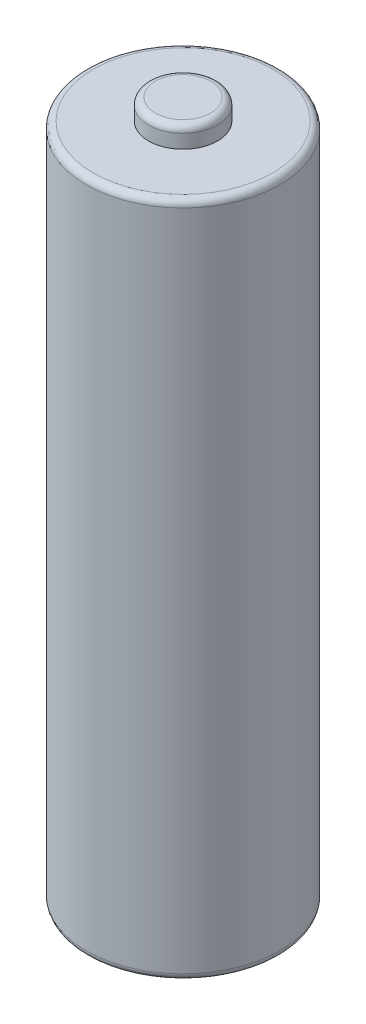
ISO-10303-21;
HEADER;
FILE_DESCRIPTION(('STEP AP214'),'2;1');
FILE_NAME('part.step','',(''),(''),'','','');
FILE_SCHEMA(('AUTOMOTIVE_DESIGN { 1 0 10303 214 1 1 1 1 }'));
ENDSEC;
DATA;
#1=APPLICATION_CONTEXT('core data for automotive mechanical design processes');
#2=APPLICATION_PROTOCOL_DEFINITION('international standard','automotive_design',2000,#1);
#3=PRODUCT_CONTEXT('',#1,'mechanical');
#4=PRODUCT('Part','Part','',(#3));
#5=PRODUCT_RELATED_PRODUCT_CATEGORY('part','',(#4));
#6=PRODUCT_DEFINITION_FORMATION('','',#4);
#7=PRODUCT_DEFINITION_CONTEXT('part definition',#1,'design');
#8=PRODUCT_DEFINITION('design','',#6,#7);
#9=PRODUCT_DEFINITION_SHAPE('','',#8);
#10=(LENGTH_UNIT() NAMED_UNIT(*) SI_UNIT(.MILLI.,.METRE.));
#11=(NAMED_UNIT(*) PLANE_ANGLE_UNIT() SI_UNIT($,.RADIAN.));
#12=(NAMED_UNIT(*) SI_UNIT($,.STERADIAN.) SOLID_ANGLE_UNIT());
#13=UNCERTAINTY_MEASURE_WITH_UNIT(LENGTH_MEASURE(1.E-05),#10,'distance_accuracy_value','');
#14=(GEOMETRIC_REPRESENTATION_CONTEXT(3) GLOBAL_UNCERTAINTY_ASSIGNED_CONTEXT((#13)) GLOBAL_UNIT_ASSIGNED_CONTEXT((#10,
#11,#12)) REPRESENTATION_CONTEXT('',''));
#15=CARTESIAN_POINT('',(0.,0.,0.));
#16=DIRECTION('',(0.,0.,1.));
#17=DIRECTION('',(1.,0.,0.));
#18=AXIS2_PLACEMENT_3D('',#15,#16,#17);
#19=CARTESIAN_POINT('',(0.,49.,0.));
#20=DIRECTION('',(0.,-1.,0.));
#21=DIRECTION('',(0.,0.,-1.));
#22=AXIS2_PLACEMENT_3D('',#19,#20,#21);
#23=CYLINDRICAL_SURFACE('',#22,7.);
#24=CARTESIAN_POINT('',(0.,0.5,0.));
#25=DIRECTION('',(0.,1.,0.));
#26=DIRECTION('',(0.,0.,1.));
#27=AXIS2_PLACEMENT_3D('',#24,#25,#26);
#28=CIRCLE('',#27,7.);
#29=CARTESIAN_POINT('',(0.,0.5,7.));
#30=VERTEX_POINT('',#29);
#31=EDGE_CURVE('E52',#30,#30,#28,.T.);
#32=ORIENTED_EDGE('',*,*,#31,.T.);
#33=EDGE_LOOP('',(#32));
#34=FACE_BOUND('',#33,.T.);
#35=CARTESIAN_POINT('',(0.,48.5,0.));
#36=DIRECTION('',(0.,1.,0.));
#37=DIRECTION('',(0.,0.,1.));
#38=AXIS2_PLACEMENT_3D('',#35,#36,#37);
#39=CIRCLE('',#38,7.);
#40=CARTESIAN_POINT('',(0.,48.5,7.));
#41=VERTEX_POINT('',#40);
#42=EDGE_CURVE('E55',#41,#41,#39,.F.);
#43=ORIENTED_EDGE('',*,*,#42,.T.);
#44=EDGE_LOOP('',(#43));
#45=FACE_BOUND('',#44,.T.);
#46=ADVANCED_FACE('F32',(#34,#45),#23,.T.);
#47=CARTESIAN_POINT('',(0.,49.,0.));
#48=DIRECTION('',(0.,1.,0.));
#49=DIRECTION('',(0.,0.,1.));
#50=AXIS2_PLACEMENT_3D('',#47,#48,#49);
#51=PLANE('',#50);
#52=CARTESIAN_POINT('',(0.,49.,0.));
#53=DIRECTION('',(0.,1.,0.));
#54=DIRECTION('',(0.,0.,1.));
#55=AXIS2_PLACEMENT_3D('',#52,#53,#54);
#56=CIRCLE('',#55,6.5);
#57=CARTESIAN_POINT('',(0.,49.,6.5));
#58=VERTEX_POINT('',#57);
#59=EDGE_CURVE('E10',#58,#58,#56,.T.);
#60=ORIENTED_EDGE('',*,*,#59,.T.);
#61=EDGE_LOOP('',(#60));
#62=FACE_BOUND('',#61,.T.);
#63=CARTESIAN_POINT('',(0.,49.,0.));
#64=DIRECTION('',(0.,1.,0.));
#65=DIRECTION('',(0.,0.,1.));
#66=AXIS2_PLACEMENT_3D('',#63,#64,#65);
#67=CIRCLE('',#66,2.5);
#68=CARTESIAN_POINT('',(0.,49.,2.5));
#69=VERTEX_POINT('',#68);
#70=EDGE_CURVE('E58',#69,#69,#67,.T.);
#71=ORIENTED_EDGE('',*,*,#70,.F.);
#72=EDGE_LOOP('',(#71));
#73=FACE_BOUND('',#72,.T.);
#74=ADVANCED_FACE('F64',(#62,#73),#51,.T.);
#75=CARTESIAN_POINT('',(0.,0.,0.));
#76=DIRECTION('',(0.,1.,0.));
#77=DIRECTION('',(0.,0.,1.));
#78=AXIS2_PLACEMENT_3D('',#75,#76,#77);
#79=PLANE('',#78);
#80=CARTESIAN_POINT('',(0.,0.,0.));
#81=DIRECTION('',(0.,1.,0.));
#82=DIRECTION('',(0.,0.,1.));
#83=AXIS2_PLACEMENT_3D('',#80,#81,#82);
#84=CIRCLE('',#83,6.5);
#85=CARTESIAN_POINT('',(0.,0.,6.5));
#86=VERTEX_POINT('',#85);
#87=EDGE_CURVE('E47',#86,#86,#84,.F.);
#88=ORIENTED_EDGE('',*,*,#87,.T.);
#89=EDGE_LOOP('',(#88));
#90=FACE_BOUND('',#89,.T.);
#91=ADVANCED_FACE('F66',(#90),#79,.F.);
#92=CARTESIAN_POINT('',(0.,50.5,0.));
#93=DIRECTION('',(0.,-1.,0.));
#94=DIRECTION('',(0.,0.,-1.));
#95=AXIS2_PLACEMENT_3D('',#92,#93,#94);
#96=CYLINDRICAL_SURFACE('',#95,2.5);
#97=CARTESIAN_POINT('',(0.,50.,0.));
#98=DIRECTION('',(0.,1.,0.));
#99=DIRECTION('',(0.,0.,1.));
#100=AXIS2_PLACEMENT_3D('',#97,#98,#99);
#101=CIRCLE('',#100,2.5);
#102=CARTESIAN_POINT('',(0.,50.,2.5));
#103=VERTEX_POINT('',#102);
#104=EDGE_CURVE('E39',#103,#103,#101,.F.);
#105=ORIENTED_EDGE('',*,*,#104,.T.);
#106=EDGE_LOOP('',(#105));
#107=FACE_BOUND('',#106,.T.);
#108=ORIENTED_EDGE('',*,*,#70,.T.);
#109=EDGE_LOOP('',(#108));
#110=FACE_BOUND('',#109,.T.);
#111=ADVANCED_FACE('F62',(#107,#110),#96,.T.);
#112=CARTESIAN_POINT('',(0.,50.5,0.));
#113=DIRECTION('',(0.,1.,0.));
#114=DIRECTION('',(0.,0.,1.));
#115=AXIS2_PLACEMENT_3D('',#112,#113,#114);
#116=PLANE('',#115);
#117=CARTESIAN_POINT('',(0.,50.5,0.));
#118=DIRECTION('',(0.,1.,0.));
#119=DIRECTION('',(0.,0.,1.));
#120=AXIS2_PLACEMENT_3D('',#117,#118,#119);
#121=CIRCLE('',#120,2.);
#122=CARTESIAN_POINT('',(0.,50.5,2.));
#123=VERTEX_POINT('',#122);
#124=EDGE_CURVE('E43',#123,#123,#121,.T.);
#125=ORIENTED_EDGE('',*,*,#124,.T.);
#126=EDGE_LOOP('',(#125));
#127=FACE_BOUND('',#126,.T.);
#128=ADVANCED_FACE('F82',(#127),#116,.T.);
#129=CARTESIAN_POINT('',(0.,0.5,0.));
#130=DIRECTION('',(0.,1.,0.));
#131=DIRECTION('',(0.,0.,1.));
#132=AXIS2_PLACEMENT_3D('',#129,#130,#131);
#133=TOROIDAL_SURFACE('',#132,6.5,0.5);
#134=ORIENTED_EDGE('',*,*,#87,.F.);
#135=EDGE_LOOP('',(#134));
#136=FACE_BOUND('',#135,.T.);
#137=ORIENTED_EDGE('',*,*,#31,.F.);
#138=EDGE_LOOP('',(#137));
#139=FACE_BOUND('',#138,.T.);
#140=ADVANCED_FACE('F79',(#136,#139),#133,.T.);
#141=CARTESIAN_POINT('',(0.,50.,0.));
#142=DIRECTION('',(0.,1.,0.));
#143=DIRECTION('',(0.,0.,1.));
#144=AXIS2_PLACEMENT_3D('',#141,#142,#143);
#145=TOROIDAL_SURFACE('',#144,2.,0.5);
#146=ORIENTED_EDGE('',*,*,#104,.F.);
#147=EDGE_LOOP('',(#146));
#148=FACE_BOUND('',#147,.T.);
#149=ORIENTED_EDGE('',*,*,#124,.F.);
#150=EDGE_LOOP('',(#149));
#151=FACE_BOUND('',#150,.T.);
#152=ADVANCED_FACE('F81',(#148,#151),#145,.T.);
#153=CARTESIAN_POINT('',(0.,48.5,0.));
#154=DIRECTION('',(0.,1.,0.));
#155=DIRECTION('',(0.,0.,1.));
#156=AXIS2_PLACEMENT_3D('',#153,#154,#155);
#157=TOROIDAL_SURFACE('',#156,6.5,0.5);
#158=ORIENTED_EDGE('',*,*,#42,.F.);
#159=EDGE_LOOP('',(#158));
#160=FACE_BOUND('',#159,.T.);
#161=ORIENTED_EDGE('',*,*,#59,.F.);
#162=EDGE_LOOP('',(#161));
#163=FACE_BOUND('',#162,.T.);
#164=ADVANCED_FACE('F34',(#160,#163),#157,.T.);
#165=CLOSED_SHELL('',(#46,#74,#91,#111,#128,#140,#152,#164));
#166=MANIFOLD_SOLID_BREP('B2',#165);
#167=ADVANCED_BREP_SHAPE_REPRESENTATION('',(#18,#166),#14);
#168=SHAPE_DEFINITION_REPRESENTATION(#9,#167);
ENDSEC;
END-ISO-10303-21;
